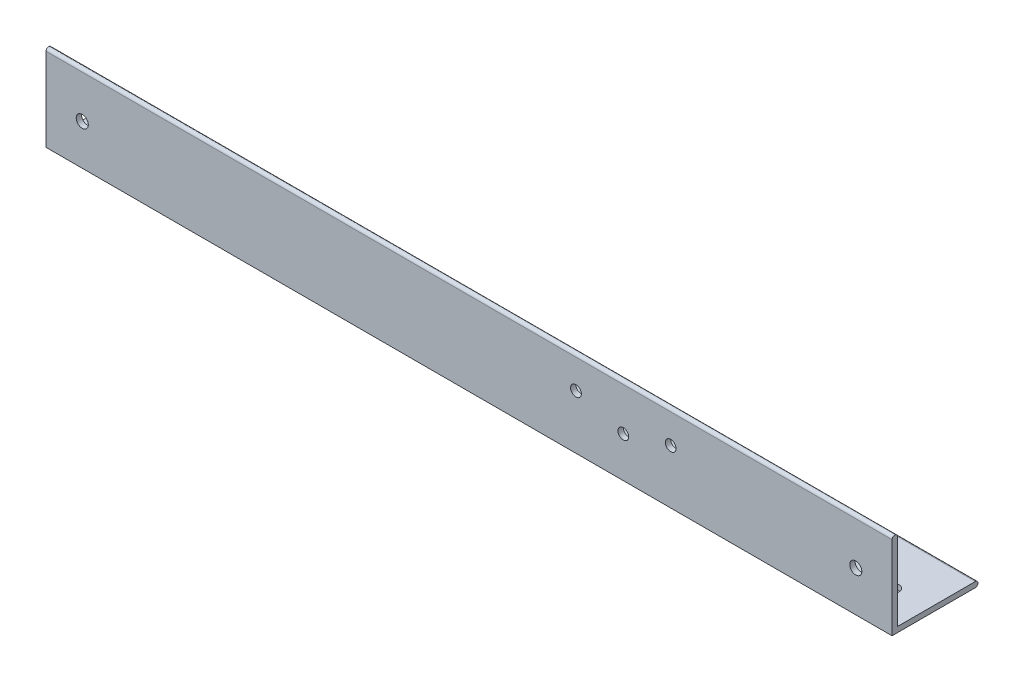
ISO-10303-21;
HEADER;
FILE_DESCRIPTION(('STEP AP214'),'2;1');
FILE_NAME('part.step','',(''),(''),'','','');
FILE_SCHEMA(('AUTOMOTIVE_DESIGN { 1 0 10303 214 1 1 1 1 }'));
ENDSEC;
DATA;
#1=APPLICATION_CONTEXT('core data for automotive mechanical design processes');
#2=APPLICATION_PROTOCOL_DEFINITION('international standard','automotive_design',2000,#1);
#3=PRODUCT_CONTEXT('',#1,'mechanical');
#4=PRODUCT('Part','Part','',(#3));
#5=PRODUCT_RELATED_PRODUCT_CATEGORY('part','',(#4));
#6=PRODUCT_DEFINITION_FORMATION('','',#4);
#7=PRODUCT_DEFINITION_CONTEXT('part definition',#1,'design');
#8=PRODUCT_DEFINITION('design','',#6,#7);
#9=PRODUCT_DEFINITION_SHAPE('','',#8);
#10=(LENGTH_UNIT() NAMED_UNIT(*) SI_UNIT(.MILLI.,.METRE.));
#11=(NAMED_UNIT(*) PLANE_ANGLE_UNIT() SI_UNIT($,.RADIAN.));
#12=(NAMED_UNIT(*) SI_UNIT($,.STERADIAN.) SOLID_ANGLE_UNIT());
#13=UNCERTAINTY_MEASURE_WITH_UNIT(LENGTH_MEASURE(1.E-05),#10,'distance_accuracy_value','');
#14=(GEOMETRIC_REPRESENTATION_CONTEXT(3) GLOBAL_UNCERTAINTY_ASSIGNED_CONTEXT((#13)) GLOBAL_UNIT_ASSIGNED_CONTEXT((#10,
#11,#12)) REPRESENTATION_CONTEXT('',''));
#15=CARTESIAN_POINT('',(0.,0.,0.));
#16=DIRECTION('',(0.,0.,1.));
#17=DIRECTION('',(1.,0.,0.));
#18=AXIS2_PLACEMENT_3D('',#15,#16,#17);
#19=CARTESIAN_POINT('',(-250.,0.793749999999999,-24.60625));
#20=DIRECTION('',(1.,0.,0.));
#21=DIRECTION('',(0.,0.,1.));
#22=AXIS2_PLACEMENT_3D('',#19,#20,#21);
#23=CYLINDRICAL_SURFACE('',#22,0.793749999999999);
#24=DIRECTION('',(1.,0.,0.));
#25=VECTOR('',#24,1.);
#26=CARTESIAN_POINT('',(-250.,1.5875,-24.60625));
#27=LINE('',#26,#25);
#28=CARTESIAN_POINT('',(-250.,1.5875,-24.60625));
#29=VERTEX_POINT('',#28);
#30=CARTESIAN_POINT('',(0.,1.5875,-24.60625));
#31=VERTEX_POINT('',#30);
#32=EDGE_CURVE('E131',#29,#31,#27,.T.);
#33=ORIENTED_EDGE('',*,*,#32,.T.);
#34=CARTESIAN_POINT('',(0.,0.793749999999999,-24.60625));
#35=DIRECTION('',(-1.,0.,0.));
#36=DIRECTION('',(0.,0.,1.));
#37=AXIS2_PLACEMENT_3D('',#34,#35,#36);
#38=CIRCLE('',#37,0.793749999999999);
#39=CARTESIAN_POINT('',(0.,0.,-24.60625));
#40=VERTEX_POINT('',#39);
#41=EDGE_CURVE('E13',#31,#40,#38,.T.);
#42=ORIENTED_EDGE('',*,*,#41,.T.);
#43=DIRECTION('',(1.,0.,0.));
#44=VECTOR('',#43,1.);
#45=CARTESIAN_POINT('',(-250.,0.,-24.60625));
#46=LINE('',#45,#44);
#47=CARTESIAN_POINT('',(-250.,0.,-24.60625));
#48=VERTEX_POINT('',#47);
#49=EDGE_CURVE('E155',#40,#48,#46,.F.);
#50=ORIENTED_EDGE('',*,*,#49,.T.);
#51=CARTESIAN_POINT('',(-250.,0.793749999999999,-24.60625));
#52=DIRECTION('',(-1.,0.,0.));
#53=DIRECTION('',(0.,0.,1.));
#54=AXIS2_PLACEMENT_3D('',#51,#52,#53);
#55=CIRCLE('',#54,0.793749999999999);
#56=EDGE_CURVE('E59',#48,#29,#55,.F.);
#57=ORIENTED_EDGE('',*,*,#56,.T.);
#58=EDGE_LOOP('',(#33,#42,#50,#57));
#59=FACE_BOUND('',#58,.T.);
#60=ADVANCED_FACE('F51',(#59),#23,.T.);
#61=CARTESIAN_POINT('',(-250.,24.60625,-0.79375));
#62=DIRECTION('',(1.,0.,0.));
#63=DIRECTION('',(0.,0.,1.));
#64=AXIS2_PLACEMENT_3D('',#61,#62,#63);
#65=CYLINDRICAL_SURFACE('',#64,0.79375);
#66=DIRECTION('',(1.,0.,0.));
#67=VECTOR('',#66,1.);
#68=CARTESIAN_POINT('',(-250.,24.60625,0.));
#69=LINE('',#68,#67);
#70=CARTESIAN_POINT('',(-250.,24.60625,0.));
#71=VERTEX_POINT('',#70);
#72=CARTESIAN_POINT('',(0.,24.60625,0.));
#73=VERTEX_POINT('',#72);
#74=EDGE_CURVE('E125',#71,#73,#69,.T.);
#75=ORIENTED_EDGE('',*,*,#74,.T.);
#76=CARTESIAN_POINT('',(0.,24.60625,-0.79375));
#77=DIRECTION('',(-1.,0.,0.));
#78=DIRECTION('',(0.,0.,1.));
#79=AXIS2_PLACEMENT_3D('',#76,#77,#78);
#80=CIRCLE('',#79,0.79375);
#81=CARTESIAN_POINT('',(0.,24.60625,-1.5875));
#82=VERTEX_POINT('',#81);
#83=EDGE_CURVE('E151',#73,#82,#80,.T.);
#84=ORIENTED_EDGE('',*,*,#83,.T.);
#85=DIRECTION('',(1.,0.,0.));
#86=VECTOR('',#85,1.);
#87=CARTESIAN_POINT('',(-250.,24.60625,-1.5875));
#88=LINE('',#87,#86);
#89=CARTESIAN_POINT('',(-250.,24.60625,-1.5875));
#90=VERTEX_POINT('',#89);
#91=EDGE_CURVE('E148',#82,#90,#88,.F.);
#92=ORIENTED_EDGE('',*,*,#91,.T.);
#93=CARTESIAN_POINT('',(-250.,24.60625,-0.79375));
#94=DIRECTION('',(-1.,0.,0.));
#95=DIRECTION('',(0.,0.,1.));
#96=AXIS2_PLACEMENT_3D('',#93,#94,#95);
#97=CIRCLE('',#96,0.79375);
#98=EDGE_CURVE('E113',#90,#71,#97,.F.);
#99=ORIENTED_EDGE('',*,*,#98,.T.);
#100=EDGE_LOOP('',(#75,#84,#92,#99));
#101=FACE_BOUND('',#100,.T.);
#102=ADVANCED_FACE('F201',(#101),#65,.T.);
#103=CARTESIAN_POINT('',(-250.,0.,-25.4));
#104=DIRECTION('',(0.,1.,0.));
#105=DIRECTION('',(0.,0.,1.));
#106=AXIS2_PLACEMENT_3D('',#103,#104,#105);
#107=PLANE('',#106);
#108=CARTESIAN_POINT('',(-166.52,0.,-10.72));
#109=DIRECTION('',(0.,-1.,0.));
#110=DIRECTION('',(0.,0.,-1.));
#111=AXIS2_PLACEMENT_3D('',#108,#109,#110);
#112=CIRCLE('',#111,2.38125000000001);
#113=CARTESIAN_POINT('',(-166.52,0.,-13.10125));
#114=VERTEX_POINT('',#113);
#115=EDGE_CURVE('E252',#114,#114,#112,.T.);
#116=ORIENTED_EDGE('',*,*,#115,.F.);
#117=EDGE_LOOP('',(#116));
#118=FACE_BOUND('',#117,.T.);
#119=CARTESIAN_POINT('',(-239.59,0.,-10.723125));
#120=DIRECTION('',(0.,1.,0.));
#121=DIRECTION('',(0.,0.,-1.));
#122=AXIS2_PLACEMENT_3D('',#119,#120,#121);
#123=CIRCLE('',#122,1.78593749999999);
#124=CARTESIAN_POINT('',(-239.59,0.,-12.5090625));
#125=VERTEX_POINT('',#124);
#126=EDGE_CURVE('E162',#125,#125,#123,.T.);
#127=ORIENTED_EDGE('',*,*,#126,.T.);
#128=EDGE_LOOP('',(#127));
#129=FACE_BOUND('',#128,.T.);
#130=CARTESIAN_POINT('',(-10.41,0.,-10.723125));
#131=DIRECTION('',(0.,1.,0.));
#132=DIRECTION('',(0.,0.,1.));
#133=AXIS2_PLACEMENT_3D('',#130,#131,#132);
#134=CIRCLE('',#133,1.7859375);
#135=CARTESIAN_POINT('',(-10.41,0.,-8.9371875));
#136=VERTEX_POINT('',#135);
#137=EDGE_CURVE('E176',#136,#136,#134,.T.);
#138=ORIENTED_EDGE('',*,*,#137,.T.);
#139=EDGE_LOOP('',(#138));
#140=FACE_BOUND('',#139,.T.);
#141=DIRECTION('',(0.,0.,-1.));
#142=VECTOR('',#141,1.);
#143=CARTESIAN_POINT('',(0.,0.,-25.4));
#144=LINE('',#143,#142);
#145=CARTESIAN_POINT('',(0.,0.,0.));
#146=VERTEX_POINT('',#145);
#147=EDGE_CURVE('E75',#146,#40,#144,.T.);
#148=ORIENTED_EDGE('',*,*,#147,.F.);
#149=DIRECTION('',(1.,0.,0.));
#150=VECTOR('',#149,1.);
#151=CARTESIAN_POINT('',(-250.,0.,0.));
#152=LINE('',#151,#150);
#153=CARTESIAN_POINT('',(-250.,0.,0.));
#154=VERTEX_POINT('',#153);
#155=EDGE_CURVE('E126',#154,#146,#152,.T.);
#156=ORIENTED_EDGE('',*,*,#155,.F.);
#157=DIRECTION('',(0.,0.,-1.));
#158=VECTOR('',#157,1.);
#159=CARTESIAN_POINT('',(-250.,0.,-25.4));
#160=LINE('',#159,#158);
#161=EDGE_CURVE('E67',#154,#48,#160,.T.);
#162=ORIENTED_EDGE('',*,*,#161,.T.);
#163=ORIENTED_EDGE('',*,*,#49,.F.);
#164=EDGE_LOOP('',(#148,#156,#162,#163));
#165=FACE_BOUND('',#164,.T.);
#166=ADVANCED_FACE('F195',(#118,#129,#140,#165),#107,.F.);
#167=CARTESIAN_POINT('',(-250.,1.5875,-1.5875));
#168=DIRECTION('',(0.,-1.,0.));
#169=DIRECTION('',(0.,0.,-1.));
#170=AXIS2_PLACEMENT_3D('',#167,#168,#169);
#171=PLANE('',#170);
#172=CARTESIAN_POINT('',(-166.52,1.5875,-10.72));
#173=DIRECTION('',(0.,-1.,0.));
#174=DIRECTION('',(0.,0.,-1.));
#175=AXIS2_PLACEMENT_3D('',#172,#173,#174);
#176=CIRCLE('',#175,2.38125000000001);
#177=CARTESIAN_POINT('',(-166.52,1.5875,-13.10125));
#178=VERTEX_POINT('',#177);
#179=EDGE_CURVE('E54',#178,#178,#176,.T.);
#180=ORIENTED_EDGE('',*,*,#179,.T.);
#181=EDGE_LOOP('',(#180));
#182=FACE_BOUND('',#181,.T.);
#183=CARTESIAN_POINT('',(-239.59,1.5875,-10.723125));
#184=DIRECTION('',(0.,1.,0.));
#185=DIRECTION('',(0.,0.,-1.));
#186=AXIS2_PLACEMENT_3D('',#183,#184,#185);
#187=CIRCLE('',#186,1.78593749999999);
#188=CARTESIAN_POINT('',(-239.59,1.5875,-12.5090625));
#189=VERTEX_POINT('',#188);
#190=EDGE_CURVE('E161',#189,#189,#187,.T.);
#191=ORIENTED_EDGE('',*,*,#190,.F.);
#192=EDGE_LOOP('',(#191));
#193=FACE_BOUND('',#192,.T.);
#194=CARTESIAN_POINT('',(-10.41,1.5875,-10.723125));
#195=DIRECTION('',(0.,1.,0.));
#196=DIRECTION('',(0.,0.,-1.));
#197=AXIS2_PLACEMENT_3D('',#194,#195,#196);
#198=CIRCLE('',#197,1.7859375);
#199=CARTESIAN_POINT('',(-10.41,1.5875,-12.5090625));
#200=VERTEX_POINT('',#199);
#201=EDGE_CURVE('E159',#200,#200,#198,.T.);
#202=ORIENTED_EDGE('',*,*,#201,.F.);
#203=EDGE_LOOP('',(#202));
#204=FACE_BOUND('',#203,.T.);
#205=DIRECTION('',(0.,0.,1.));
#206=VECTOR('',#205,1.);
#207=CARTESIAN_POINT('',(-250.,1.5875,-1.5875));
#208=LINE('',#207,#206);
#209=CARTESIAN_POINT('',(-250.,1.5875,-1.5875));
#210=VERTEX_POINT('',#209);
#211=EDGE_CURVE('E110',#29,#210,#208,.T.);
#212=ORIENTED_EDGE('',*,*,#211,.T.);
#213=DIRECTION('',(1.,0.,0.));
#214=VECTOR('',#213,1.);
#215=CARTESIAN_POINT('',(-250.,1.5875,-1.5875));
#216=LINE('',#215,#214);
#217=CARTESIAN_POINT('',(0.,1.5875,-1.5875));
#218=VERTEX_POINT('',#217);
#219=EDGE_CURVE('E120',#210,#218,#216,.T.);
#220=ORIENTED_EDGE('',*,*,#219,.T.);
#221=DIRECTION('',(0.,0.,1.));
#222=VECTOR('',#221,1.);
#223=CARTESIAN_POINT('',(0.,1.5875,-1.5875));
#224=LINE('',#223,#222);
#225=EDGE_CURVE('E139',#31,#218,#224,.T.);
#226=ORIENTED_EDGE('',*,*,#225,.F.);
#227=ORIENTED_EDGE('',*,*,#32,.F.);
#228=EDGE_LOOP('',(#212,#220,#226,#227));
#229=FACE_BOUND('',#228,.T.);
#230=ADVANCED_FACE('F129',(#182,#193,#204,#229),#171,.F.);
#231=CARTESIAN_POINT('',(-250.,25.4,-1.5875));
#232=DIRECTION('',(0.,0.,1.));
#233=DIRECTION('',(0.,-1.,0.));
#234=AXIS2_PLACEMENT_3D('',#231,#232,#233);
#235=PLANE('',#234);
#236=CARTESIAN_POINT('',(-65.4,15.99625,-1.5875));
#237=DIRECTION('',(0.,0.,-1.));
#238=DIRECTION('',(0.,-1.,0.));
#239=AXIS2_PLACEMENT_3D('',#236,#237,#238);
#240=CIRCLE('',#239,1.5875);
#241=CARTESIAN_POINT('',(-65.4,14.40875,-1.5875));
#242=VERTEX_POINT('',#241);
#243=EDGE_CURVE('E272',#242,#242,#240,.T.);
#244=ORIENTED_EDGE('',*,*,#243,.F.);
#245=EDGE_LOOP('',(#244));
#246=FACE_BOUND('',#245,.T.);
#247=CARTESIAN_POINT('',(-79.4,11.99625,-1.5875));
#248=DIRECTION('',(0.,0.,-1.));
#249=DIRECTION('',(0.,-1.,0.));
#250=AXIS2_PLACEMENT_3D('',#247,#248,#249);
#251=CIRCLE('',#250,1.5875);
#252=CARTESIAN_POINT('',(-79.4,10.40875,-1.5875));
#253=VERTEX_POINT('',#252);
#254=EDGE_CURVE('E269',#253,#253,#251,.T.);
#255=ORIENTED_EDGE('',*,*,#254,.F.);
#256=EDGE_LOOP('',(#255));
#257=FACE_BOUND('',#256,.T.);
#258=CARTESIAN_POINT('',(-93.4,15.99625,-1.5875));
#259=DIRECTION('',(0.,0.,-1.));
#260=DIRECTION('',(0.,-1.,0.));
#261=AXIS2_PLACEMENT_3D('',#258,#259,#260);
#262=CIRCLE('',#261,1.58999999999999);
#263=CARTESIAN_POINT('',(-93.4,14.40625,-1.5875));
#264=VERTEX_POINT('',#263);
#265=EDGE_CURVE('E264',#264,#264,#262,.T.);
#266=ORIENTED_EDGE('',*,*,#265,.F.);
#267=EDGE_LOOP('',(#266));
#268=FACE_BOUND('',#267,.T.);
#269=CARTESIAN_POINT('',(-239.286497308104,12.,-1.5875));
#270=DIRECTION('',(0.,0.,-1.));
#271=DIRECTION('',(0.,-1.,0.));
#272=AXIS2_PLACEMENT_3D('',#269,#270,#271);
#273=CIRCLE('',#272,1.7859375);
#274=CARTESIAN_POINT('',(-239.286497308104,10.2140625,-1.5875));
#275=VERTEX_POINT('',#274);
#276=EDGE_CURVE('E168',#275,#275,#273,.F.);
#277=ORIENTED_EDGE('',*,*,#276,.T.);
#278=EDGE_LOOP('',(#277));
#279=FACE_BOUND('',#278,.T.);
#280=CARTESIAN_POINT('',(-10.7135026918963,12.,-1.5875));
#281=DIRECTION('',(0.,0.,-1.));
#282=DIRECTION('',(0.,-1.,0.));
#283=AXIS2_PLACEMENT_3D('',#280,#281,#282);
#284=CIRCLE('',#283,1.7859375);
#285=CARTESIAN_POINT('',(-10.7135026918963,10.2140625,-1.5875));
#286=VERTEX_POINT('',#285);
#287=EDGE_CURVE('E140',#286,#286,#284,.T.);
#288=ORIENTED_EDGE('',*,*,#287,.F.);
#289=EDGE_LOOP('',(#288));
#290=FACE_BOUND('',#289,.T.);
#291=DIRECTION('',(0.,1.,0.));
#292=VECTOR('',#291,1.);
#293=CARTESIAN_POINT('',(0.,25.4,-1.5875));
#294=LINE('',#293,#292);
#295=EDGE_CURVE('E122',#218,#82,#294,.T.);
#296=ORIENTED_EDGE('',*,*,#295,.F.);
#297=ORIENTED_EDGE('',*,*,#219,.F.);
#298=DIRECTION('',(0.,1.,0.));
#299=VECTOR('',#298,1.);
#300=CARTESIAN_POINT('',(-250.,25.4,-1.5875));
#301=LINE('',#300,#299);
#302=EDGE_CURVE('E106',#210,#90,#301,.T.);
#303=ORIENTED_EDGE('',*,*,#302,.T.);
#304=ORIENTED_EDGE('',*,*,#91,.F.);
#305=EDGE_LOOP('',(#296,#297,#303,#304));
#306=FACE_BOUND('',#305,.T.);
#307=ADVANCED_FACE('F121',(#246,#257,#268,#279,#290,#306),#235,.F.);
#308=CARTESIAN_POINT('',(-250.,0.,0.));
#309=DIRECTION('',(0.,0.,-1.));
#310=DIRECTION('',(1.,0.,0.));
#311=AXIS2_PLACEMENT_3D('',#308,#309,#310);
#312=PLANE('',#311);
#313=CARTESIAN_POINT('',(-65.4,15.99625,0.));
#314=DIRECTION('',(0.,0.,-1.));
#315=DIRECTION('',(-1.,0.,0.));
#316=AXIS2_PLACEMENT_3D('',#313,#314,#315);
#317=CIRCLE('',#316,1.5875);
#318=CARTESIAN_POINT('',(-66.9875,15.99625,0.));
#319=VERTEX_POINT('',#318);
#320=EDGE_CURVE('E261',#319,#319,#317,.T.);
#321=ORIENTED_EDGE('',*,*,#320,.T.);
#322=EDGE_LOOP('',(#321));
#323=FACE_BOUND('',#322,.T.);
#324=CARTESIAN_POINT('',(-79.4,11.99625,0.));
#325=DIRECTION('',(0.,0.,-1.));
#326=DIRECTION('',(-1.,0.,0.));
#327=AXIS2_PLACEMENT_3D('',#324,#325,#326);
#328=CIRCLE('',#327,1.5875);
#329=CARTESIAN_POINT('',(-80.9875,11.99625,0.));
#330=VERTEX_POINT('',#329);
#331=EDGE_CURVE('E257',#330,#330,#328,.T.);
#332=ORIENTED_EDGE('',*,*,#331,.T.);
#333=EDGE_LOOP('',(#332));
#334=FACE_BOUND('',#333,.T.);
#335=CARTESIAN_POINT('',(-93.4,15.99625,0.));
#336=DIRECTION('',(0.,0.,-1.));
#337=DIRECTION('',(-1.,0.,0.));
#338=AXIS2_PLACEMENT_3D('',#335,#336,#337);
#339=CIRCLE('',#338,1.58999999999999);
#340=CARTESIAN_POINT('',(-94.99,15.99625,0.));
#341=VERTEX_POINT('',#340);
#342=EDGE_CURVE('E255',#341,#341,#339,.T.);
#343=ORIENTED_EDGE('',*,*,#342,.T.);
#344=EDGE_LOOP('',(#343));
#345=FACE_BOUND('',#344,.T.);
#346=CARTESIAN_POINT('',(-239.286497308104,12.,0.));
#347=DIRECTION('',(0.,0.,1.));
#348=DIRECTION('',(1.,0.,0.));
#349=AXIS2_PLACEMENT_3D('',#346,#347,#348);
#350=CIRCLE('',#349,1.7859375);
#351=CARTESIAN_POINT('',(-237.500559808104,12.,0.));
#352=VERTEX_POINT('',#351);
#353=EDGE_CURVE('E164',#352,#352,#350,.T.);
#354=ORIENTED_EDGE('',*,*,#353,.F.);
#355=EDGE_LOOP('',(#354));
#356=FACE_BOUND('',#355,.T.);
#357=CARTESIAN_POINT('',(-10.7135026918963,12.,0.));
#358=DIRECTION('',(0.,0.,-1.));
#359=DIRECTION('',(-1.,0.,0.));
#360=AXIS2_PLACEMENT_3D('',#357,#358,#359);
#361=CIRCLE('',#360,1.7859375);
#362=CARTESIAN_POINT('',(-12.4994401918963,12.,0.));
#363=VERTEX_POINT('',#362);
#364=EDGE_CURVE('E173',#363,#363,#361,.T.);
#365=ORIENTED_EDGE('',*,*,#364,.T.);
#366=EDGE_LOOP('',(#365));
#367=FACE_BOUND('',#366,.T.);
#368=DIRECTION('',(0.,-1.,0.));
#369=VECTOR('',#368,1.);
#370=CARTESIAN_POINT('',(-250.,0.,0.));
#371=LINE('',#370,#369);
#372=EDGE_CURVE('E117',#71,#154,#371,.T.);
#373=ORIENTED_EDGE('',*,*,#372,.T.);
#374=ORIENTED_EDGE('',*,*,#155,.T.);
#375=DIRECTION('',(0.,-1.,0.));
#376=VECTOR('',#375,1.);
#377=CARTESIAN_POINT('',(0.,0.,0.));
#378=LINE('',#377,#376);
#379=EDGE_CURVE('E133',#73,#146,#378,.T.);
#380=ORIENTED_EDGE('',*,*,#379,.F.);
#381=ORIENTED_EDGE('',*,*,#74,.F.);
#382=EDGE_LOOP('',(#373,#374,#380,#381));
#383=FACE_BOUND('',#382,.T.);
#384=ADVANCED_FACE('F186',(#323,#334,#345,#356,#367,#383),#312,.F.);
#385=CARTESIAN_POINT('',(-250.,0.,0.));
#386=DIRECTION('',(1.,0.,0.));
#387=DIRECTION('',(0.,0.,1.));
#388=AXIS2_PLACEMENT_3D('',#385,#386,#387);
#389=PLANE('',#388);
#390=ORIENTED_EDGE('',*,*,#161,.F.);
#391=ORIENTED_EDGE('',*,*,#372,.F.);
#392=ORIENTED_EDGE('',*,*,#98,.F.);
#393=ORIENTED_EDGE('',*,*,#302,.F.);
#394=ORIENTED_EDGE('',*,*,#211,.F.);
#395=ORIENTED_EDGE('',*,*,#56,.F.);
#396=EDGE_LOOP('',(#390,#391,#392,#393,#394,#395));
#397=FACE_BOUND('',#396,.T.);
#398=ADVANCED_FACE('F108',(#397),#389,.F.);
#399=CARTESIAN_POINT('',(0.,0.,0.));
#400=DIRECTION('',(1.,0.,0.));
#401=DIRECTION('',(0.,0.,1.));
#402=AXIS2_PLACEMENT_3D('',#399,#400,#401);
#403=PLANE('',#402);
#404=ORIENTED_EDGE('',*,*,#225,.T.);
#405=ORIENTED_EDGE('',*,*,#295,.T.);
#406=ORIENTED_EDGE('',*,*,#83,.F.);
#407=ORIENTED_EDGE('',*,*,#379,.T.);
#408=ORIENTED_EDGE('',*,*,#147,.T.);
#409=ORIENTED_EDGE('',*,*,#41,.F.);
#410=EDGE_LOOP('',(#404,#405,#406,#407,#408,#409));
#411=FACE_BOUND('',#410,.T.);
#412=ADVANCED_FACE('F210',(#411),#403,.T.);
#413=CARTESIAN_POINT('',(-10.7135026918963,12.,-25.4));
#414=DIRECTION('',(0.,0.,1.));
#415=DIRECTION('',(-1.,0.,0.));
#416=AXIS2_PLACEMENT_3D('',#413,#414,#415);
#417=CYLINDRICAL_SURFACE('',#416,1.7859375);
#418=ORIENTED_EDGE('',*,*,#364,.F.);
#419=EDGE_LOOP('',(#418));
#420=FACE_BOUND('',#419,.T.);
#421=ORIENTED_EDGE('',*,*,#287,.T.);
#422=EDGE_LOOP('',(#421));
#423=FACE_BOUND('',#422,.T.);
#424=ADVANCED_FACE('F183',(#420,#423),#417,.F.);
#425=CARTESIAN_POINT('',(-239.286497308104,12.,-25.4));
#426=DIRECTION('',(0.,0.,1.));
#427=DIRECTION('',(-1.,0.,0.));
#428=AXIS2_PLACEMENT_3D('',#425,#426,#427);
#429=CYLINDRICAL_SURFACE('',#428,1.7859375);
#430=ORIENTED_EDGE('',*,*,#353,.T.);
#431=EDGE_LOOP('',(#430));
#432=FACE_BOUND('',#431,.T.);
#433=ORIENTED_EDGE('',*,*,#276,.F.);
#434=EDGE_LOOP('',(#433));
#435=FACE_BOUND('',#434,.T.);
#436=ADVANCED_FACE('F217',(#432,#435),#429,.F.);
#437=CARTESIAN_POINT('',(-10.41,25.4,-10.723125));
#438=DIRECTION('',(0.,-1.,0.));
#439=DIRECTION('',(0.,0.,-1.));
#440=AXIS2_PLACEMENT_3D('',#437,#438,#439);
#441=CYLINDRICAL_SURFACE('',#440,1.7859375);
#442=ORIENTED_EDGE('',*,*,#137,.F.);
#443=EDGE_LOOP('',(#442));
#444=FACE_BOUND('',#443,.T.);
#445=ORIENTED_EDGE('',*,*,#201,.T.);
#446=EDGE_LOOP('',(#445));
#447=FACE_BOUND('',#446,.T.);
#448=ADVANCED_FACE('F224',(#444,#447),#441,.F.);
#449=CARTESIAN_POINT('',(-239.59,25.4,-10.723125));
#450=DIRECTION('',(0.,-1.,0.));
#451=DIRECTION('',(0.,0.,-1.));
#452=AXIS2_PLACEMENT_3D('',#449,#450,#451);
#453=CYLINDRICAL_SURFACE('',#452,1.78593749999999);
#454=ORIENTED_EDGE('',*,*,#126,.F.);
#455=EDGE_LOOP('',(#454));
#456=FACE_BOUND('',#455,.T.);
#457=ORIENTED_EDGE('',*,*,#190,.T.);
#458=EDGE_LOOP('',(#457));
#459=FACE_BOUND('',#458,.T.);
#460=ADVANCED_FACE('F227',(#456,#459),#453,.F.);
#461=CARTESIAN_POINT('',(-93.4,15.99625,-25.4));
#462=DIRECTION('',(0.,0.,1.));
#463=DIRECTION('',(-1.,0.,0.));
#464=AXIS2_PLACEMENT_3D('',#461,#462,#463);
#465=CYLINDRICAL_SURFACE('',#464,1.58999999999999);
#466=ORIENTED_EDGE('',*,*,#342,.F.);
#467=EDGE_LOOP('',(#466));
#468=FACE_BOUND('',#467,.T.);
#469=ORIENTED_EDGE('',*,*,#265,.T.);
#470=EDGE_LOOP('',(#469));
#471=FACE_BOUND('',#470,.T.);
#472=ADVANCED_FACE('F231',(#468,#471),#465,.F.);
#473=CARTESIAN_POINT('',(-79.4,11.99625,-25.4));
#474=DIRECTION('',(0.,0.,1.));
#475=DIRECTION('',(-1.,0.,0.));
#476=AXIS2_PLACEMENT_3D('',#473,#474,#475);
#477=CYLINDRICAL_SURFACE('',#476,1.5875);
#478=ORIENTED_EDGE('',*,*,#331,.F.);
#479=EDGE_LOOP('',(#478));
#480=FACE_BOUND('',#479,.T.);
#481=ORIENTED_EDGE('',*,*,#254,.T.);
#482=EDGE_LOOP('',(#481));
#483=FACE_BOUND('',#482,.T.);
#484=ADVANCED_FACE('F235',(#480,#483),#477,.F.);
#485=CARTESIAN_POINT('',(-65.4,15.99625,-25.4));
#486=DIRECTION('',(0.,0.,1.));
#487=DIRECTION('',(-1.,0.,0.));
#488=AXIS2_PLACEMENT_3D('',#485,#486,#487);
#489=CYLINDRICAL_SURFACE('',#488,1.5875);
#490=ORIENTED_EDGE('',*,*,#320,.F.);
#491=EDGE_LOOP('',(#490));
#492=FACE_BOUND('',#491,.T.);
#493=ORIENTED_EDGE('',*,*,#243,.T.);
#494=EDGE_LOOP('',(#493));
#495=FACE_BOUND('',#494,.T.);
#496=ADVANCED_FACE('F239',(#492,#495),#489,.F.);
#497=CARTESIAN_POINT('',(-166.52,10.,-10.72));
#498=DIRECTION('',(0.,-1.,0.));
#499=DIRECTION('',(0.,0.,-1.));
#500=AXIS2_PLACEMENT_3D('',#497,#498,#499);
#501=CYLINDRICAL_SURFACE('',#500,2.38125000000001);
#502=ORIENTED_EDGE('',*,*,#115,.T.);
#503=EDGE_LOOP('',(#502));
#504=FACE_BOUND('',#503,.T.);
#505=ORIENTED_EDGE('',*,*,#179,.F.);
#506=EDGE_LOOP('',(#505));
#507=FACE_BOUND('',#506,.T.);
#508=ADVANCED_FACE('F243',(#504,#507),#501,.F.);
#509=CLOSED_SHELL('',(#60,#102,#166,#230,#307,#384,#398,#412,#424,#436,#448,#460,#472,#484,#496,#508));
#510=MANIFOLD_SOLID_BREP('B2',#509);
#511=ADVANCED_BREP_SHAPE_REPRESENTATION('',(#18,#510),#14);
#512=SHAPE_DEFINITION_REPRESENTATION(#9,#511);
ENDSEC;
END-ISO-10303-21;
